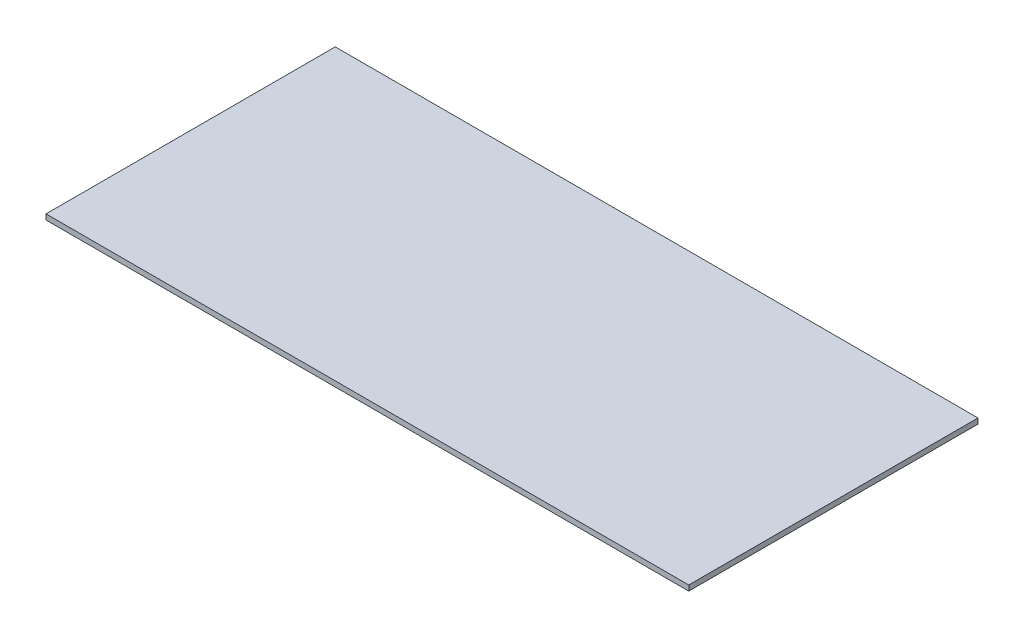
ISO-10303-21;
HEADER;
FILE_DESCRIPTION(('STEP AP214'),'2;1');
FILE_NAME('part.step','',(''),(''),'','','');
FILE_SCHEMA(('AUTOMOTIVE_DESIGN { 1 0 10303 214 1 1 1 1 }'));
ENDSEC;
DATA;
#1=APPLICATION_CONTEXT('core data for automotive mechanical design processes');
#2=APPLICATION_PROTOCOL_DEFINITION('international standard','automotive_design',2000,#1);
#3=PRODUCT_CONTEXT('',#1,'mechanical');
#4=PRODUCT('Part','Part','',(#3));
#5=PRODUCT_RELATED_PRODUCT_CATEGORY('part','',(#4));
#6=PRODUCT_DEFINITION_FORMATION('','',#4);
#7=PRODUCT_DEFINITION_CONTEXT('part definition',#1,'design');
#8=PRODUCT_DEFINITION('design','',#6,#7);
#9=PRODUCT_DEFINITION_SHAPE('','',#8);
#10=(LENGTH_UNIT() NAMED_UNIT(*) SI_UNIT(.MILLI.,.METRE.));
#11=(NAMED_UNIT(*) PLANE_ANGLE_UNIT() SI_UNIT($,.RADIAN.));
#12=(NAMED_UNIT(*) SI_UNIT($,.STERADIAN.) SOLID_ANGLE_UNIT());
#13=UNCERTAINTY_MEASURE_WITH_UNIT(LENGTH_MEASURE(1.E-05),#10,'distance_accuracy_value','');
#14=(GEOMETRIC_REPRESENTATION_CONTEXT(3) GLOBAL_UNCERTAINTY_ASSIGNED_CONTEXT((#13)) GLOBAL_UNIT_ASSIGNED_CONTEXT((#10,
#11,#12)) REPRESENTATION_CONTEXT('',''));
#15=CARTESIAN_POINT('',(0.,0.,0.));
#16=DIRECTION('',(0.,0.,1.));
#17=DIRECTION('',(1.,0.,0.));
#18=AXIS2_PLACEMENT_3D('',#15,#16,#17);
#19=CARTESIAN_POINT('',(-300.,5.,-135.));
#20=DIRECTION('',(1.,0.,0.));
#21=DIRECTION('',(0.,0.,-1.));
#22=AXIS2_PLACEMENT_3D('',#19,#20,#21);
#23=PLANE('',#22);
#24=DIRECTION('',(0.,0.,1.));
#25=VECTOR('',#24,1.);
#26=CARTESIAN_POINT('',(-300.,0.,-135.));
#27=LINE('',#26,#25);
#28=CARTESIAN_POINT('',(-300.,0.,-135.));
#29=VERTEX_POINT('',#28);
#30=CARTESIAN_POINT('',(-300.,0.,135.));
#31=VERTEX_POINT('',#30);
#32=EDGE_CURVE('E95',#29,#31,#27,.T.);
#33=ORIENTED_EDGE('',*,*,#32,.T.);
#34=DIRECTION('',(0.,-1.,0.));
#35=VECTOR('',#34,1.);
#36=CARTESIAN_POINT('',(-300.,5.,135.));
#37=LINE('',#36,#35);
#38=CARTESIAN_POINT('',(-300.,5.,135.));
#39=VERTEX_POINT('',#38);
#40=EDGE_CURVE('E11',#39,#31,#37,.T.);
#41=ORIENTED_EDGE('',*,*,#40,.F.);
#42=DIRECTION('',(0.,0.,1.));
#43=VECTOR('',#42,1.);
#44=CARTESIAN_POINT('',(-300.,5.,-135.));
#45=LINE('',#44,#43);
#46=CARTESIAN_POINT('',(-300.,5.,-135.));
#47=VERTEX_POINT('',#46);
#48=EDGE_CURVE('E83',#47,#39,#45,.T.);
#49=ORIENTED_EDGE('',*,*,#48,.F.);
#50=DIRECTION('',(0.,-1.,0.));
#51=VECTOR('',#50,1.);
#52=CARTESIAN_POINT('',(-300.,5.,-135.));
#53=LINE('',#52,#51);
#54=EDGE_CURVE('E91',#47,#29,#53,.T.);
#55=ORIENTED_EDGE('',*,*,#54,.T.);
#56=EDGE_LOOP('',(#33,#41,#49,#55));
#57=FACE_BOUND('',#56,.T.);
#58=ADVANCED_FACE('F32',(#57),#23,.F.);
#59=CARTESIAN_POINT('',(-300.,5.,135.));
#60=DIRECTION('',(0.,0.,-1.));
#61=DIRECTION('',(-1.,0.,0.));
#62=AXIS2_PLACEMENT_3D('',#59,#60,#61);
#63=PLANE('',#62);
#64=DIRECTION('',(1.,0.,0.));
#65=VECTOR('',#64,1.);
#66=CARTESIAN_POINT('',(-300.,0.,135.));
#67=LINE('',#66,#65);
#68=CARTESIAN_POINT('',(300.,0.,135.));
#69=VERTEX_POINT('',#68);
#70=EDGE_CURVE('E87',#31,#69,#67,.T.);
#71=ORIENTED_EDGE('',*,*,#70,.T.);
#72=DIRECTION('',(0.,-1.,0.));
#73=VECTOR('',#72,1.);
#74=CARTESIAN_POINT('',(300.,5.,135.));
#75=LINE('',#74,#73);
#76=CARTESIAN_POINT('',(300.,5.,135.));
#77=VERTEX_POINT('',#76);
#78=EDGE_CURVE('E40',#77,#69,#75,.T.);
#79=ORIENTED_EDGE('',*,*,#78,.F.);
#80=DIRECTION('',(1.,0.,0.));
#81=VECTOR('',#80,1.);
#82=CARTESIAN_POINT('',(-300.,5.,135.));
#83=LINE('',#82,#81);
#84=EDGE_CURVE('E78',#39,#77,#83,.T.);
#85=ORIENTED_EDGE('',*,*,#84,.F.);
#86=ORIENTED_EDGE('',*,*,#40,.T.);
#87=EDGE_LOOP('',(#71,#79,#85,#86));
#88=FACE_BOUND('',#87,.T.);
#89=ADVANCED_FACE('F86',(#88),#63,.F.);
#90=CARTESIAN_POINT('',(300.,5.,-135.));
#91=DIRECTION('',(-1.,0.,0.));
#92=DIRECTION('',(0.,0.,1.));
#93=AXIS2_PLACEMENT_3D('',#90,#91,#92);
#94=PLANE('',#93);
#95=DIRECTION('',(0.,0.,-1.));
#96=VECTOR('',#95,1.);
#97=CARTESIAN_POINT('',(300.,0.,-135.));
#98=LINE('',#97,#96);
#99=CARTESIAN_POINT('',(300.,0.,-135.));
#100=VERTEX_POINT('',#99);
#101=EDGE_CURVE('E65',#69,#100,#98,.T.);
#102=ORIENTED_EDGE('',*,*,#101,.T.);
#103=DIRECTION('',(0.,-1.,0.));
#104=VECTOR('',#103,1.);
#105=CARTESIAN_POINT('',(300.,5.,-135.));
#106=LINE('',#105,#104);
#107=CARTESIAN_POINT('',(300.,5.,-135.));
#108=VERTEX_POINT('',#107);
#109=EDGE_CURVE('E88',#108,#100,#106,.T.);
#110=ORIENTED_EDGE('',*,*,#109,.F.);
#111=DIRECTION('',(0.,0.,-1.));
#112=VECTOR('',#111,1.);
#113=CARTESIAN_POINT('',(300.,5.,-135.));
#114=LINE('',#113,#112);
#115=EDGE_CURVE('E81',#77,#108,#114,.T.);
#116=ORIENTED_EDGE('',*,*,#115,.F.);
#117=ORIENTED_EDGE('',*,*,#78,.T.);
#118=EDGE_LOOP('',(#102,#110,#116,#117));
#119=FACE_BOUND('',#118,.T.);
#120=ADVANCED_FACE('F89',(#119),#94,.F.);
#121=CARTESIAN_POINT('',(-300.,5.,-135.));
#122=DIRECTION('',(0.,0.,1.));
#123=DIRECTION('',(1.,0.,0.));
#124=AXIS2_PLACEMENT_3D('',#121,#122,#123);
#125=PLANE('',#124);
#126=DIRECTION('',(-1.,0.,0.));
#127=VECTOR('',#126,1.);
#128=CARTESIAN_POINT('',(-300.,0.,-135.));
#129=LINE('',#128,#127);
#130=EDGE_CURVE('E71',#100,#29,#129,.T.);
#131=ORIENTED_EDGE('',*,*,#130,.T.);
#132=ORIENTED_EDGE('',*,*,#54,.F.);
#133=DIRECTION('',(-1.,0.,0.));
#134=VECTOR('',#133,1.);
#135=CARTESIAN_POINT('',(-300.,5.,-135.));
#136=LINE('',#135,#134);
#137=EDGE_CURVE('E48',#108,#47,#136,.T.);
#138=ORIENTED_EDGE('',*,*,#137,.F.);
#139=ORIENTED_EDGE('',*,*,#109,.T.);
#140=EDGE_LOOP('',(#131,#132,#138,#139));
#141=FACE_BOUND('',#140,.T.);
#142=ADVANCED_FACE('F102',(#141),#125,.F.);
#143=CARTESIAN_POINT('',(0.,5.,0.));
#144=DIRECTION('',(0.,1.,0.));
#145=DIRECTION('',(0.,0.,1.));
#146=AXIS2_PLACEMENT_3D('',#143,#144,#145);
#147=PLANE('',#146);
#148=ORIENTED_EDGE('',*,*,#48,.T.);
#149=ORIENTED_EDGE('',*,*,#84,.T.);
#150=ORIENTED_EDGE('',*,*,#115,.T.);
#151=ORIENTED_EDGE('',*,*,#137,.T.);
#152=EDGE_LOOP('',(#148,#149,#150,#151));
#153=FACE_BOUND('',#152,.T.);
#154=ADVANCED_FACE('F79',(#153),#147,.T.);
#155=CARTESIAN_POINT('',(0.,0.,0.));
#156=DIRECTION('',(0.,1.,0.));
#157=DIRECTION('',(0.,0.,1.));
#158=AXIS2_PLACEMENT_3D('',#155,#156,#157);
#159=PLANE('',#158);
#160=ORIENTED_EDGE('',*,*,#32,.F.);
#161=ORIENTED_EDGE('',*,*,#130,.F.);
#162=ORIENTED_EDGE('',*,*,#101,.F.);
#163=ORIENTED_EDGE('',*,*,#70,.F.);
#164=EDGE_LOOP('',(#160,#161,#162,#163));
#165=FACE_BOUND('',#164,.T.);
#166=ADVANCED_FACE('F105',(#165),#159,.F.);
#167=CLOSED_SHELL('',(#58,#89,#120,#142,#154,#166));
#168=MANIFOLD_SOLID_BREP('B2',#167);
#169=ADVANCED_BREP_SHAPE_REPRESENTATION('',(#18,#168),#14);
#170=SHAPE_DEFINITION_REPRESENTATION(#9,#169);
ENDSEC;
END-ISO-10303-21;
